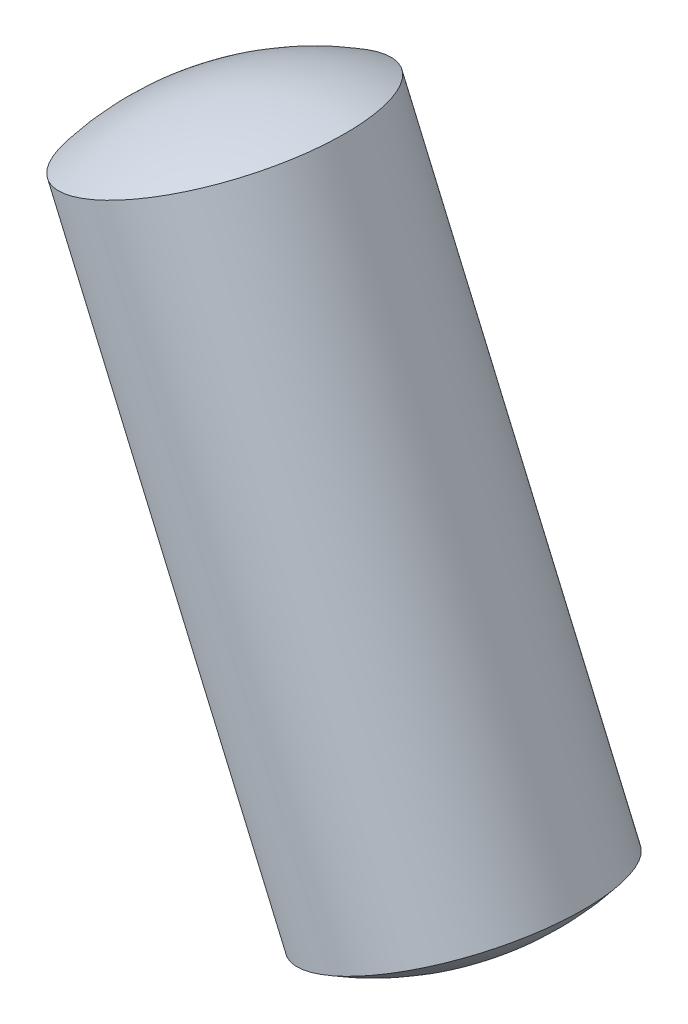
ISO-10303-21;
HEADER;
FILE_DESCRIPTION(('STEP AP214'),'2;1');
FILE_NAME('part.step','',(''),(''),'','','');
FILE_SCHEMA(('AUTOMOTIVE_DESIGN { 1 0 10303 214 1 1 1 1 }'));
ENDSEC;
DATA;
#1=APPLICATION_CONTEXT('core data for automotive mechanical design processes');
#2=APPLICATION_PROTOCOL_DEFINITION('international standard','automotive_design',2000,#1);
#3=PRODUCT_CONTEXT('',#1,'mechanical');
#4=PRODUCT('Part','Part','',(#3));
#5=PRODUCT_RELATED_PRODUCT_CATEGORY('part','',(#4));
#6=PRODUCT_DEFINITION_FORMATION('','',#4);
#7=PRODUCT_DEFINITION_CONTEXT('part definition',#1,'design');
#8=PRODUCT_DEFINITION('design','',#6,#7);
#9=PRODUCT_DEFINITION_SHAPE('','',#8);
#10=(LENGTH_UNIT() NAMED_UNIT(*) SI_UNIT(.MILLI.,.METRE.));
#11=(NAMED_UNIT(*) PLANE_ANGLE_UNIT() SI_UNIT($,.RADIAN.));
#12=(NAMED_UNIT(*) SI_UNIT($,.STERADIAN.) SOLID_ANGLE_UNIT());
#13=UNCERTAINTY_MEASURE_WITH_UNIT(LENGTH_MEASURE(1.E-05),#10,'distance_accuracy_value','');
#14=(GEOMETRIC_REPRESENTATION_CONTEXT(3) GLOBAL_UNCERTAINTY_ASSIGNED_CONTEXT((#13)) GLOBAL_UNIT_ASSIGNED_CONTEXT((#10,
#11,#12)) REPRESENTATION_CONTEXT('',''));
#15=CARTESIAN_POINT('',(0.,0.,0.));
#16=DIRECTION('',(0.,0.,1.));
#17=DIRECTION('',(1.,0.,0.));
#18=AXIS2_PLACEMENT_3D('',#15,#16,#17);
#19=CARTESIAN_POINT('',(8.84042999659982,-20.48693484002,0.599999999999989));
#20=DIRECTION('',(-0.918163469263382,-0.396201771462762,0.));
#21=DIRECTION('',(0.396201771462762,-0.918163469263382,0.));
#22=AXIS2_PLACEMENT_3D('',#19,#20,#21);
#23=SPHERICAL_SURFACE('',#22,2.);
#24=CARTESIAN_POINT('',(8.84042999659982,-20.48693484002,0.599999999999989));
#25=DIRECTION('',(-0.396201771462762,0.918163469263382,0.));
#26=DIRECTION('',(0.,0.,-1.));
#27=AXIS2_PLACEMENT_3D('',#24,#25,#26);
#28=SPHERICAL_SURFACE('',#27,2.);
#29=CARTESIAN_POINT('',(9.52667159482216,-22.0772406184381,0.599999999999989));
#30=DIRECTION('',(-0.396201771462762,0.918163469263382,0.));
#31=DIRECTION('',(0.,0.,-1.));
#32=AXIS2_PLACEMENT_3D('',#29,#30,#31);
#33=CIRCLE('',#32,1.);
#34=CARTESIAN_POINT('',(9.52667159482216,-22.0772406184381,-0.400000000000011));
#35=VERTEX_POINT('',#34);
#36=EDGE_CURVE('E11',#35,#35,#33,.T.);
#37=ORIENTED_EDGE('',*,*,#36,.F.);
#38=EDGE_LOOP('',(#37));
#39=FACE_BOUND('',#38,.T.);
#40=ADVANCED_FACE('F17',(#39),#28,.T.);
#41=CARTESIAN_POINT('',(8.39434706203035,-19.453176072937,0.599999999999989));
#42=DIRECTION('',(-0.918163469263382,-0.396201771462762,0.));
#43=DIRECTION('',(-0.396201771462762,0.918163469263382,0.));
#44=AXIS2_PLACEMENT_3D('',#41,#42,#43);
#45=SPHERICAL_SURFACE('',#44,2.);
#46=CARTESIAN_POINT('',(8.39434706203035,-19.453176072937,0.599999999999989));
#47=DIRECTION('',(-0.396201771462762,0.918163469263382,0.));
#48=DIRECTION('',(0.,0.,-1.));
#49=AXIS2_PLACEMENT_3D('',#46,#47,#48);
#50=SPHERICAL_SURFACE('',#49,2.);
#51=CARTESIAN_POINT('',(7.70810546380802,-17.862870294519,0.599999999999989));
#52=DIRECTION('',(-0.396201771462762,0.918163469263382,0.));
#53=DIRECTION('',(0.,0.,-1.));
#54=AXIS2_PLACEMENT_3D('',#51,#52,#53);
#55=CIRCLE('',#54,1.);
#56=CARTESIAN_POINT('',(7.70810546380802,-17.862870294519,-0.400000000000011));
#57=VERTEX_POINT('',#56);
#58=EDGE_CURVE('E25',#57,#57,#55,.T.);
#59=ORIENTED_EDGE('',*,*,#58,.T.);
#60=EDGE_LOOP('',(#59));
#61=FACE_BOUND('',#60,.T.);
#62=ADVANCED_FACE('F39',(#61),#50,.T.);
#63=CARTESIAN_POINT('',(8.16274699656158,-18.9164628754989,0.599999999999989));
#64=DIRECTION('',(-0.396201771462762,0.918163469263382,0.));
#65=DIRECTION('',(0.,0.,-1.));
#66=AXIS2_PLACEMENT_3D('',#63,#64,#65);
#67=CYLINDRICAL_SURFACE('',#66,1.);
#68=ORIENTED_EDGE('',*,*,#36,.T.);
#69=EDGE_LOOP('',(#68));
#70=FACE_BOUND('',#69,.T.);
#71=ORIENTED_EDGE('',*,*,#58,.F.);
#72=EDGE_LOOP('',(#71));
#73=FACE_BOUND('',#72,.T.);
#74=ADVANCED_FACE('F51',(#70,#73),#67,.T.);
#75=CLOSED_SHELL('',(#40,#62,#74));
#76=MANIFOLD_SOLID_BREP('B1',#75);
#77=ADVANCED_BREP_SHAPE_REPRESENTATION('',(#18,#76),#14);
#78=SHAPE_DEFINITION_REPRESENTATION(#9,#77);
ENDSEC;
END-ISO-10303-21;
